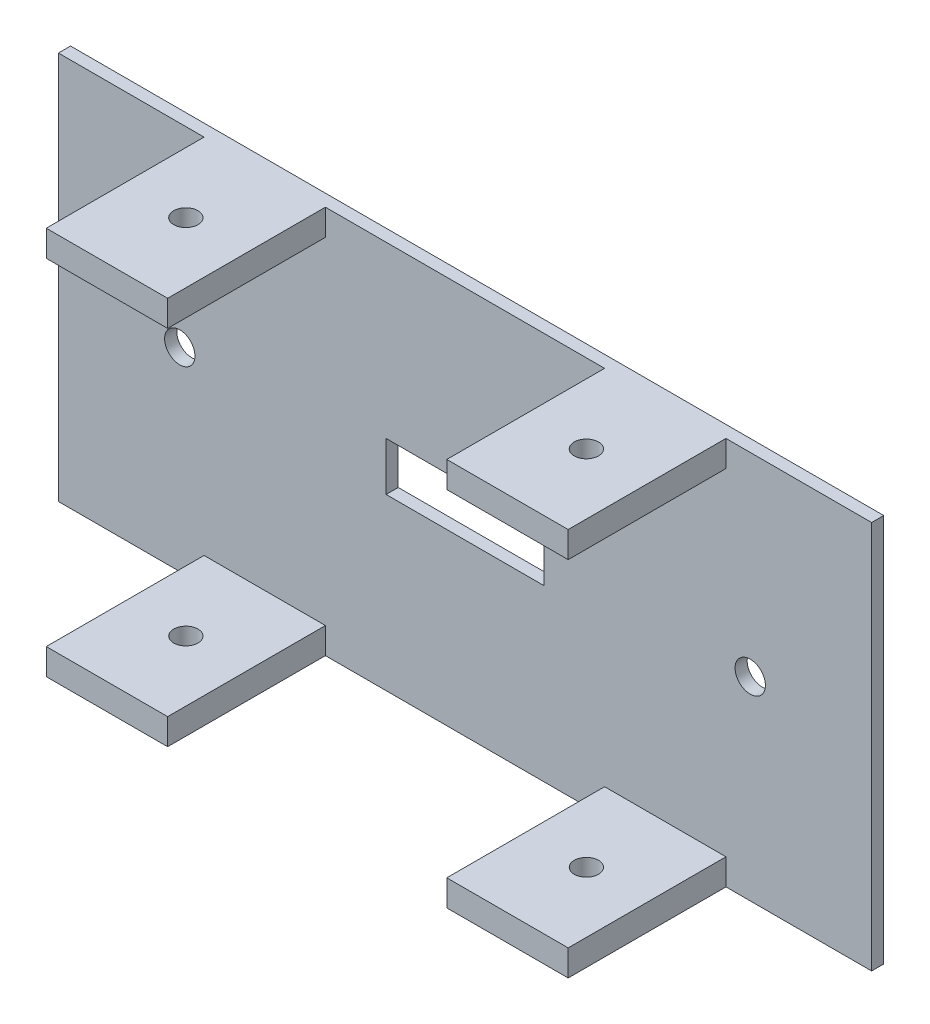
ISO-10303-21;
HEADER;
FILE_DESCRIPTION(('STEP AP214'),'2;1');
FILE_NAME('part.step','',(''),(''),'','','');
FILE_SCHEMA(('AUTOMOTIVE_DESIGN { 1 0 10303 214 1 1 1 1 }'));
ENDSEC;
DATA;
#1=APPLICATION_CONTEXT('core data for automotive mechanical design processes');
#2=APPLICATION_PROTOCOL_DEFINITION('international standard','automotive_design',2000,#1);
#3=PRODUCT_CONTEXT('',#1,'mechanical');
#4=PRODUCT('Part','Part','',(#3));
#5=PRODUCT_RELATED_PRODUCT_CATEGORY('part','',(#4));
#6=PRODUCT_DEFINITION_FORMATION('','',#4);
#7=PRODUCT_DEFINITION_CONTEXT('part definition',#1,'design');
#8=PRODUCT_DEFINITION('design','',#6,#7);
#9=PRODUCT_DEFINITION_SHAPE('','',#8);
#10=(LENGTH_UNIT() NAMED_UNIT(*) SI_UNIT(.MILLI.,.METRE.));
#11=(NAMED_UNIT(*) PLANE_ANGLE_UNIT() SI_UNIT($,.RADIAN.));
#12=(NAMED_UNIT(*) SI_UNIT($,.STERADIAN.) SOLID_ANGLE_UNIT());
#13=UNCERTAINTY_MEASURE_WITH_UNIT(LENGTH_MEASURE(1.E-05),#10,'distance_accuracy_value','');
#14=(GEOMETRIC_REPRESENTATION_CONTEXT(3) GLOBAL_UNCERTAINTY_ASSIGNED_CONTEXT((#13)) GLOBAL_UNIT_ASSIGNED_CONTEXT((#10,
#11,#12)) REPRESENTATION_CONTEXT('',''));
#15=CARTESIAN_POINT('',(0.,0.,0.));
#16=DIRECTION('',(0.,0.,1.));
#17=DIRECTION('',(1.,0.,0.));
#18=AXIS2_PLACEMENT_3D('',#15,#16,#17);
#19=CARTESIAN_POINT('',(0.,0.,2.));
#20=DIRECTION('',(0.,0.,1.));
#21=DIRECTION('',(1.,0.,0.));
#22=AXIS2_PLACEMENT_3D('',#19,#20,#21);
#23=PLANE('',#22);
#24=DIRECTION('',(0.,-1.,0.));
#25=VECTOR('',#24,1.);
#26=CARTESIAN_POINT('',(-13.,0.,2.));
#27=LINE('',#26,#25);
#28=CARTESIAN_POINT('',(-13.,4.,2.));
#29=VERTEX_POINT('',#28);
#30=CARTESIAN_POINT('',(-13.,-4.,2.));
#31=VERTEX_POINT('',#30);
#32=EDGE_CURVE('E268',#29,#31,#27,.T.);
#33=ORIENTED_EDGE('',*,*,#32,.F.);
#34=DIRECTION('',(1.,0.,0.));
#35=VECTOR('',#34,1.);
#36=CARTESIAN_POINT('',(0.,4.,2.));
#37=LINE('',#36,#35);
#38=CARTESIAN_POINT('',(13.,4.,2.));
#39=VERTEX_POINT('',#38);
#40=EDGE_CURVE('E246',#29,#39,#37,.T.);
#41=ORIENTED_EDGE('',*,*,#40,.T.);
#42=DIRECTION('',(0.,-1.,0.));
#43=VECTOR('',#42,1.);
#44=CARTESIAN_POINT('',(13.,0.,2.));
#45=LINE('',#44,#43);
#46=CARTESIAN_POINT('',(13.,-4.,2.));
#47=VERTEX_POINT('',#46);
#48=EDGE_CURVE('E263',#39,#47,#45,.T.);
#49=ORIENTED_EDGE('',*,*,#48,.T.);
#50=DIRECTION('',(1.,0.,0.));
#51=VECTOR('',#50,1.);
#52=CARTESIAN_POINT('',(0.,-4.,2.));
#53=LINE('',#52,#51);
#54=EDGE_CURVE('E37',#31,#47,#53,.T.);
#55=ORIENTED_EDGE('',*,*,#54,.F.);
#56=EDGE_LOOP('',(#33,#41,#49,#55));
#57=FACE_BOUND('',#56,.T.);
#58=DIRECTION('',(1.,0.,0.));
#59=VECTOR('',#58,1.);
#60=CARTESIAN_POINT('',(0.,32.,2.));
#61=LINE('',#60,#59);
#62=CARTESIAN_POINT('',(43.,32.,2.));
#63=VERTEX_POINT('',#62);
#64=CARTESIAN_POINT('',(67.,32.,2.));
#65=VERTEX_POINT('',#64);
#66=EDGE_CURVE('E479',#63,#65,#61,.T.);
#67=ORIENTED_EDGE('',*,*,#66,.F.);
#68=DIRECTION('',(0.,-1.,0.));
#69=VECTOR('',#68,1.);
#70=CARTESIAN_POINT('',(43.,29.85,2.));
#71=LINE('',#70,#69);
#72=CARTESIAN_POINT('',(43.,27.7,2.));
#73=VERTEX_POINT('',#72);
#74=EDGE_CURVE('E301',#63,#73,#71,.T.);
#75=ORIENTED_EDGE('',*,*,#74,.T.);
#76=DIRECTION('',(-1.,0.,0.));
#77=VECTOR('',#76,1.);
#78=CARTESIAN_POINT('',(33.,27.7,2.));
#79=LINE('',#78,#77);
#80=CARTESIAN_POINT('',(23.,27.7,2.));
#81=VERTEX_POINT('',#80);
#82=EDGE_CURVE('E332',#73,#81,#79,.T.);
#83=ORIENTED_EDGE('',*,*,#82,.T.);
#84=DIRECTION('',(0.,-1.,0.));
#85=VECTOR('',#84,1.);
#86=CARTESIAN_POINT('',(23.,29.85,2.));
#87=LINE('',#86,#85);
#88=CARTESIAN_POINT('',(23.,32.,2.));
#89=VERTEX_POINT('',#88);
#90=EDGE_CURVE('E318',#89,#81,#87,.T.);
#91=ORIENTED_EDGE('',*,*,#90,.F.);
#92=CARTESIAN_POINT('',(-23.,32.,2.));
#93=VERTEX_POINT('',#92);
#94=EDGE_CURVE('E478',#93,#89,#61,.T.);
#95=ORIENTED_EDGE('',*,*,#94,.F.);
#96=DIRECTION('',(0.,-1.,0.));
#97=VECTOR('',#96,1.);
#98=CARTESIAN_POINT('',(-23.,29.85,2.));
#99=LINE('',#98,#97);
#100=CARTESIAN_POINT('',(-23.,27.7,2.));
#101=VERTEX_POINT('',#100);
#102=EDGE_CURVE('E431',#93,#101,#99,.T.);
#103=ORIENTED_EDGE('',*,*,#102,.T.);
#104=DIRECTION('',(1.,0.,0.));
#105=VECTOR('',#104,1.);
#106=CARTESIAN_POINT('',(-33.,27.7,2.));
#107=LINE('',#106,#105);
#108=CARTESIAN_POINT('',(-43.,27.7,2.));
#109=VERTEX_POINT('',#108);
#110=EDGE_CURVE('E450',#109,#101,#107,.T.);
#111=ORIENTED_EDGE('',*,*,#110,.F.);
#112=DIRECTION('',(0.,-1.,0.));
#113=VECTOR('',#112,1.);
#114=CARTESIAN_POINT('',(-43.,29.85,2.));
#115=LINE('',#114,#113);
#116=CARTESIAN_POINT('',(-43.,32.,2.));
#117=VERTEX_POINT('',#116);
#118=EDGE_CURVE('E437',#117,#109,#115,.T.);
#119=ORIENTED_EDGE('',*,*,#118,.F.);
#120=CARTESIAN_POINT('',(-67.,32.,2.));
#121=VERTEX_POINT('',#120);
#122=EDGE_CURVE('E473',#121,#117,#61,.T.);
#123=ORIENTED_EDGE('',*,*,#122,.F.);
#124=DIRECTION('',(0.,-1.,0.));
#125=VECTOR('',#124,1.);
#126=CARTESIAN_POINT('',(-67.,0.,2.));
#127=LINE('',#126,#125);
#128=CARTESIAN_POINT('',(-67.,-32.,2.));
#129=VERTEX_POINT('',#128);
#130=EDGE_CURVE('E477',#121,#129,#127,.T.);
#131=ORIENTED_EDGE('',*,*,#130,.T.);
#132=DIRECTION('',(1.,0.,0.));
#133=VECTOR('',#132,1.);
#134=CARTESIAN_POINT('',(0.,-32.,2.));
#135=LINE('',#134,#133);
#136=CARTESIAN_POINT('',(-43.,-32.,2.));
#137=VERTEX_POINT('',#136);
#138=EDGE_CURVE('E483',#129,#137,#135,.T.);
#139=ORIENTED_EDGE('',*,*,#138,.T.);
#140=DIRECTION('',(0.,1.,0.));
#141=VECTOR('',#140,1.);
#142=CARTESIAN_POINT('',(-43.,-29.85,2.));
#143=LINE('',#142,#141);
#144=CARTESIAN_POINT('',(-43.,-27.7,2.));
#145=VERTEX_POINT('',#144);
#146=EDGE_CURVE('E383',#137,#145,#143,.T.);
#147=ORIENTED_EDGE('',*,*,#146,.T.);
#148=DIRECTION('',(1.,0.,0.));
#149=VECTOR('',#148,1.);
#150=CARTESIAN_POINT('',(-33.,-27.7,2.));
#151=LINE('',#150,#149);
#152=CARTESIAN_POINT('',(-23.,-27.7,2.));
#153=VERTEX_POINT('',#152);
#154=EDGE_CURVE('E397',#145,#153,#151,.T.);
#155=ORIENTED_EDGE('',*,*,#154,.T.);
#156=DIRECTION('',(0.,1.,0.));
#157=VECTOR('',#156,1.);
#158=CARTESIAN_POINT('',(-23.,-29.85,2.));
#159=LINE('',#158,#157);
#160=CARTESIAN_POINT('',(-23.,-32.,2.));
#161=VERTEX_POINT('',#160);
#162=EDGE_CURVE('E410',#161,#153,#159,.T.);
#163=ORIENTED_EDGE('',*,*,#162,.F.);
#164=CARTESIAN_POINT('',(23.,-32.,2.));
#165=VERTEX_POINT('',#164);
#166=EDGE_CURVE('E487',#161,#165,#135,.T.);
#167=ORIENTED_EDGE('',*,*,#166,.T.);
#168=DIRECTION('',(0.,1.,0.));
#169=VECTOR('',#168,1.);
#170=CARTESIAN_POINT('',(23.,-29.85,2.));
#171=LINE('',#170,#169);
#172=CARTESIAN_POINT('',(23.,-27.7,2.));
#173=VERTEX_POINT('',#172);
#174=EDGE_CURVE('E342',#165,#173,#171,.T.);
#175=ORIENTED_EDGE('',*,*,#174,.T.);
#176=DIRECTION('',(-1.,0.,0.));
#177=VECTOR('',#176,1.);
#178=CARTESIAN_POINT('',(33.,-27.7,2.));
#179=LINE('',#178,#177);
#180=CARTESIAN_POINT('',(43.,-27.7,2.));
#181=VERTEX_POINT('',#180);
#182=EDGE_CURVE('E373',#181,#173,#179,.T.);
#183=ORIENTED_EDGE('',*,*,#182,.F.);
#184=DIRECTION('',(0.,1.,0.));
#185=VECTOR('',#184,1.);
#186=CARTESIAN_POINT('',(43.,-29.85,2.));
#187=LINE('',#186,#185);
#188=CARTESIAN_POINT('',(43.,-32.,2.));
#189=VERTEX_POINT('',#188);
#190=EDGE_CURVE('E359',#189,#181,#187,.T.);
#191=ORIENTED_EDGE('',*,*,#190,.F.);
#192=CARTESIAN_POINT('',(67.,-32.,2.));
#193=VERTEX_POINT('',#192);
#194=EDGE_CURVE('E482',#189,#193,#135,.T.);
#195=ORIENTED_EDGE('',*,*,#194,.T.);
#196=DIRECTION('',(0.,-1.,0.));
#197=VECTOR('',#196,1.);
#198=CARTESIAN_POINT('',(67.,0.,2.));
#199=LINE('',#198,#197);
#200=EDGE_CURVE('E486',#65,#193,#199,.T.);
#201=ORIENTED_EDGE('',*,*,#200,.F.);
#202=EDGE_LOOP('',(#67,#75,#83,#91,#95,#103,#111,#119,#123,#131,#139,#147,#155,#163,#167,#175,
#183,#191,#195,#201));
#203=FACE_BOUND('',#202,.T.);
#204=CARTESIAN_POINT('',(-47.,0.,2.));
#205=DIRECTION('',(0.,0.,1.));
#206=DIRECTION('',(1.,0.,0.));
#207=AXIS2_PLACEMENT_3D('',#204,#205,#206);
#208=CIRCLE('',#207,2.5);
#209=CARTESIAN_POINT('',(-44.5,0.,2.));
#210=VERTEX_POINT('',#209);
#211=EDGE_CURVE('E839',#210,#210,#208,.T.);
#212=ORIENTED_EDGE('',*,*,#211,.F.);
#213=EDGE_LOOP('',(#212));
#214=FACE_BOUND('',#213,.T.);
#215=CARTESIAN_POINT('',(47.,0.,2.));
#216=DIRECTION('',(0.,0.,-1.));
#217=DIRECTION('',(1.,0.,0.));
#218=AXIS2_PLACEMENT_3D('',#215,#216,#217);
#219=CIRCLE('',#218,2.5);
#220=CARTESIAN_POINT('',(49.5,0.,2.));
#221=VERTEX_POINT('',#220);
#222=EDGE_CURVE('E834',#221,#221,#219,.T.);
#223=ORIENTED_EDGE('',*,*,#222,.T.);
#224=EDGE_LOOP('',(#223));
#225=FACE_BOUND('',#224,.T.);
#226=ADVANCED_FACE('F16',(#57,#203,#214,#225),#23,.T.);
#227=CARTESIAN_POINT('',(0.,0.,0.));
#228=DIRECTION('',(0.,0.,1.));
#229=DIRECTION('',(1.,0.,0.));
#230=AXIS2_PLACEMENT_3D('',#227,#228,#229);
#231=PLANE('',#230);
#232=CARTESIAN_POINT('',(-47.,0.,0.));
#233=DIRECTION('',(0.,0.,1.));
#234=DIRECTION('',(1.,0.,0.));
#235=AXIS2_PLACEMENT_3D('',#232,#233,#234);
#236=CIRCLE('',#235,2.5);
#237=CARTESIAN_POINT('',(-44.5,0.,0.));
#238=VERTEX_POINT('',#237);
#239=EDGE_CURVE('E266',#238,#238,#236,.T.);
#240=ORIENTED_EDGE('',*,*,#239,.T.);
#241=EDGE_LOOP('',(#240));
#242=FACE_BOUND('',#241,.T.);
#243=DIRECTION('',(1.,0.,0.));
#244=VECTOR('',#243,1.);
#245=CARTESIAN_POINT('',(0.,32.,0.));
#246=LINE('',#245,#244);
#247=CARTESIAN_POINT('',(-67.,32.,0.));
#248=VERTEX_POINT('',#247);
#249=CARTESIAN_POINT('',(67.,32.,0.));
#250=VERTEX_POINT('',#249);
#251=EDGE_CURVE('E461',#248,#250,#246,.T.);
#252=ORIENTED_EDGE('',*,*,#251,.T.);
#253=DIRECTION('',(0.,-1.,0.));
#254=VECTOR('',#253,1.);
#255=CARTESIAN_POINT('',(67.,0.,0.));
#256=LINE('',#255,#254);
#257=CARTESIAN_POINT('',(67.,-32.,0.));
#258=VERTEX_POINT('',#257);
#259=EDGE_CURVE('E502',#250,#258,#256,.T.);
#260=ORIENTED_EDGE('',*,*,#259,.T.);
#261=DIRECTION('',(1.,0.,0.));
#262=VECTOR('',#261,1.);
#263=CARTESIAN_POINT('',(0.,-32.,0.));
#264=LINE('',#263,#262);
#265=CARTESIAN_POINT('',(-67.,-32.,0.));
#266=VERTEX_POINT('',#265);
#267=EDGE_CURVE('E498',#266,#258,#264,.T.);
#268=ORIENTED_EDGE('',*,*,#267,.F.);
#269=DIRECTION('',(0.,-1.,0.));
#270=VECTOR('',#269,1.);
#271=CARTESIAN_POINT('',(-67.,0.,0.));
#272=LINE('',#271,#270);
#273=EDGE_CURVE('E495',#248,#266,#272,.T.);
#274=ORIENTED_EDGE('',*,*,#273,.F.);
#275=EDGE_LOOP('',(#252,#260,#268,#274));
#276=FACE_BOUND('',#275,.T.);
#277=DIRECTION('',(1.,0.,0.));
#278=VECTOR('',#277,1.);
#279=CARTESIAN_POINT('',(0.,4.,0.));
#280=LINE('',#279,#278);
#281=CARTESIAN_POINT('',(-13.,4.,0.));
#282=VERTEX_POINT('',#281);
#283=CARTESIAN_POINT('',(13.,4.,0.));
#284=VERTEX_POINT('',#283);
#285=EDGE_CURVE('E49',#282,#284,#280,.T.);
#286=ORIENTED_EDGE('',*,*,#285,.F.);
#287=DIRECTION('',(0.,-1.,0.));
#288=VECTOR('',#287,1.);
#289=CARTESIAN_POINT('',(-13.,0.,0.));
#290=LINE('',#289,#288);
#291=CARTESIAN_POINT('',(-13.,-4.,0.));
#292=VERTEX_POINT('',#291);
#293=EDGE_CURVE('E251',#282,#292,#290,.T.);
#294=ORIENTED_EDGE('',*,*,#293,.T.);
#295=DIRECTION('',(1.,0.,0.));
#296=VECTOR('',#295,1.);
#297=CARTESIAN_POINT('',(0.,-4.,0.));
#298=LINE('',#297,#296);
#299=CARTESIAN_POINT('',(13.,-4.,0.));
#300=VERTEX_POINT('',#299);
#301=EDGE_CURVE('E232',#292,#300,#298,.T.);
#302=ORIENTED_EDGE('',*,*,#301,.T.);
#303=DIRECTION('',(0.,-1.,0.));
#304=VECTOR('',#303,1.);
#305=CARTESIAN_POINT('',(13.,0.,0.));
#306=LINE('',#305,#304);
#307=EDGE_CURVE('E242',#284,#300,#306,.T.);
#308=ORIENTED_EDGE('',*,*,#307,.F.);
#309=EDGE_LOOP('',(#286,#294,#302,#308));
#310=FACE_BOUND('',#309,.T.);
#311=CARTESIAN_POINT('',(47.,0.,0.));
#312=DIRECTION('',(0.,0.,-1.));
#313=DIRECTION('',(1.,0.,0.));
#314=AXIS2_PLACEMENT_3D('',#311,#312,#313);
#315=CIRCLE('',#314,2.5);
#316=CARTESIAN_POINT('',(49.5,0.,0.));
#317=VERTEX_POINT('',#316);
#318=EDGE_CURVE('E831',#317,#317,#315,.T.);
#319=ORIENTED_EDGE('',*,*,#318,.F.);
#320=EDGE_LOOP('',(#319));
#321=FACE_BOUND('',#320,.T.);
#322=ADVANCED_FACE('F248',(#242,#276,#310,#321),#231,.F.);
#323=CARTESIAN_POINT('',(0.,32.,2.));
#324=DIRECTION('',(0.,1.,0.));
#325=DIRECTION('',(-1.,0.,0.));
#326=AXIS2_PLACEMENT_3D('',#323,#324,#325);
#327=PLANE('',#326);
#328=CARTESIAN_POINT('',(-33.,32.,15.));
#329=DIRECTION('',(0.,-1.,0.));
#330=DIRECTION('',(-1.,0.,0.));
#331=AXIS2_PLACEMENT_3D('',#328,#329,#330);
#332=CIRCLE('',#331,2.);
#333=CARTESIAN_POINT('',(-35.,32.,15.));
#334=VERTEX_POINT('',#333);
#335=EDGE_CURVE('E276',#334,#334,#332,.T.);
#336=ORIENTED_EDGE('',*,*,#335,.T.);
#337=EDGE_LOOP('',(#336));
#338=FACE_BOUND('',#337,.T.);
#339=ORIENTED_EDGE('',*,*,#251,.F.);
#340=DIRECTION('',(0.,0.,-1.));
#341=VECTOR('',#340,1.);
#342=CARTESIAN_POINT('',(-67.,32.,2.));
#343=LINE('',#342,#341);
#344=EDGE_CURVE('E10',#121,#248,#343,.T.);
#345=ORIENTED_EDGE('',*,*,#344,.F.);
#346=ORIENTED_EDGE('',*,*,#122,.T.);
#347=DIRECTION('',(0.,0.,-1.));
#348=VECTOR('',#347,1.);
#349=CARTESIAN_POINT('',(-43.,32.,28.));
#350=LINE('',#349,#348);
#351=CARTESIAN_POINT('',(-43.,32.,28.));
#352=VERTEX_POINT('',#351);
#353=EDGE_CURVE('E457',#352,#117,#350,.T.);
#354=ORIENTED_EDGE('',*,*,#353,.F.);
#355=DIRECTION('',(1.,0.,0.));
#356=VECTOR('',#355,1.);
#357=CARTESIAN_POINT('',(0.,32.,28.));
#358=LINE('',#357,#356);
#359=CARTESIAN_POINT('',(-23.,32.,28.));
#360=VERTEX_POINT('',#359);
#361=EDGE_CURVE('E443',#352,#360,#358,.T.);
#362=ORIENTED_EDGE('',*,*,#361,.T.);
#363=DIRECTION('',(0.,0.,-1.));
#364=VECTOR('',#363,1.);
#365=CARTESIAN_POINT('',(-23.,32.,28.));
#366=LINE('',#365,#364);
#367=EDGE_CURVE('E447',#360,#93,#366,.T.);
#368=ORIENTED_EDGE('',*,*,#367,.T.);
#369=ORIENTED_EDGE('',*,*,#94,.T.);
#370=DIRECTION('',(0.,0.,-1.));
#371=VECTOR('',#370,1.);
#372=CARTESIAN_POINT('',(23.,32.,28.));
#373=LINE('',#372,#371);
#374=CARTESIAN_POINT('',(23.,32.,28.));
#375=VERTEX_POINT('',#374);
#376=EDGE_CURVE('E338',#375,#89,#373,.T.);
#377=ORIENTED_EDGE('',*,*,#376,.F.);
#378=DIRECTION('',(1.,0.,0.));
#379=VECTOR('',#378,1.);
#380=CARTESIAN_POINT('',(0.,32.,28.));
#381=LINE('',#380,#379);
#382=CARTESIAN_POINT('',(43.,32.,28.));
#383=VERTEX_POINT('',#382);
#384=EDGE_CURVE('E325',#375,#383,#381,.T.);
#385=ORIENTED_EDGE('',*,*,#384,.T.);
#386=DIRECTION('',(0.,0.,-1.));
#387=VECTOR('',#386,1.);
#388=CARTESIAN_POINT('',(43.,32.,28.));
#389=LINE('',#388,#387);
#390=EDGE_CURVE('E329',#383,#63,#389,.T.);
#391=ORIENTED_EDGE('',*,*,#390,.T.);
#392=ORIENTED_EDGE('',*,*,#66,.T.);
#393=DIRECTION('',(0.,0.,-1.));
#394=VECTOR('',#393,1.);
#395=CARTESIAN_POINT('',(67.,32.,2.));
#396=LINE('',#395,#394);
#397=EDGE_CURVE('E491',#65,#250,#396,.T.);
#398=ORIENTED_EDGE('',*,*,#397,.T.);
#399=EDGE_LOOP('',(#339,#345,#346,#354,#362,#368,#369,#377,#385,#391,#392,#398));
#400=FACE_BOUND('',#399,.T.);
#401=CARTESIAN_POINT('',(33.,32.,15.));
#402=DIRECTION('',(0.,1.,0.));
#403=DIRECTION('',(-1.,0.,0.));
#404=AXIS2_PLACEMENT_3D('',#401,#402,#403);
#405=CIRCLE('',#404,2.);
#406=CARTESIAN_POINT('',(31.,32.,15.));
#407=VERTEX_POINT('',#406);
#408=EDGE_CURVE('E286',#407,#407,#405,.T.);
#409=ORIENTED_EDGE('',*,*,#408,.F.);
#410=EDGE_LOOP('',(#409));
#411=FACE_BOUND('',#410,.T.);
#412=ADVANCED_FACE('F18',(#338,#400,#411),#327,.T.);
#413=CARTESIAN_POINT('',(0.,-32.,2.));
#414=DIRECTION('',(0.,1.,0.));
#415=DIRECTION('',(-1.,0.,0.));
#416=AXIS2_PLACEMENT_3D('',#413,#414,#415);
#417=PLANE('',#416);
#418=ORIENTED_EDGE('',*,*,#267,.T.);
#419=DIRECTION('',(0.,0.,-1.));
#420=VECTOR('',#419,1.);
#421=CARTESIAN_POINT('',(67.,-32.,2.));
#422=LINE('',#421,#420);
#423=EDGE_CURVE('E508',#193,#258,#422,.T.);
#424=ORIENTED_EDGE('',*,*,#423,.F.);
#425=ORIENTED_EDGE('',*,*,#194,.F.);
#426=DIRECTION('',(0.,0.,-1.));
#427=VECTOR('',#426,1.);
#428=CARTESIAN_POINT('',(43.,-32.,28.));
#429=LINE('',#428,#427);
#430=CARTESIAN_POINT('',(43.,-32.,28.));
#431=VERTEX_POINT('',#430);
#432=EDGE_CURVE('E380',#431,#189,#429,.T.);
#433=ORIENTED_EDGE('',*,*,#432,.F.);
#434=DIRECTION('',(1.,0.,0.));
#435=VECTOR('',#434,1.);
#436=CARTESIAN_POINT('',(0.,-32.,28.));
#437=LINE('',#436,#435);
#438=CARTESIAN_POINT('',(23.,-32.,28.));
#439=VERTEX_POINT('',#438);
#440=EDGE_CURVE('E365',#439,#431,#437,.T.);
#441=ORIENTED_EDGE('',*,*,#440,.F.);
#442=DIRECTION('',(0.,0.,-1.));
#443=VECTOR('',#442,1.);
#444=CARTESIAN_POINT('',(23.,-32.,28.));
#445=LINE('',#444,#443);
#446=EDGE_CURVE('E369',#439,#165,#445,.T.);
#447=ORIENTED_EDGE('',*,*,#446,.T.);
#448=ORIENTED_EDGE('',*,*,#166,.F.);
#449=DIRECTION('',(0.,0.,-1.));
#450=VECTOR('',#449,1.);
#451=CARTESIAN_POINT('',(-23.,-32.,28.));
#452=LINE('',#451,#450);
#453=CARTESIAN_POINT('',(-23.,-32.,28.));
#454=VERTEX_POINT('',#453);
#455=EDGE_CURVE('E423',#454,#161,#452,.T.);
#456=ORIENTED_EDGE('',*,*,#455,.F.);
#457=DIRECTION('',(1.,0.,0.));
#458=VECTOR('',#457,1.);
#459=CARTESIAN_POINT('',(0.,-32.,28.));
#460=LINE('',#459,#458);
#461=CARTESIAN_POINT('',(-43.,-32.,28.));
#462=VERTEX_POINT('',#461);
#463=EDGE_CURVE('E396',#462,#454,#460,.T.);
#464=ORIENTED_EDGE('',*,*,#463,.F.);
#465=DIRECTION('',(0.,0.,-1.));
#466=VECTOR('',#465,1.);
#467=CARTESIAN_POINT('',(-43.,-32.,28.));
#468=LINE('',#467,#466);
#469=EDGE_CURVE('E427',#462,#137,#468,.T.);
#470=ORIENTED_EDGE('',*,*,#469,.T.);
#471=ORIENTED_EDGE('',*,*,#138,.F.);
#472=DIRECTION('',(0.,0.,-1.));
#473=VECTOR('',#472,1.);
#474=CARTESIAN_POINT('',(-67.,-32.,2.));
#475=LINE('',#474,#473);
#476=EDGE_CURVE('E25',#129,#266,#475,.T.);
#477=ORIENTED_EDGE('',*,*,#476,.T.);
#478=EDGE_LOOP('',(#418,#424,#425,#433,#441,#447,#448,#456,#464,#470,#471,#477));
#479=FACE_BOUND('',#478,.T.);
#480=CARTESIAN_POINT('',(33.,-32.,15.));
#481=DIRECTION('',(0.,1.,0.));
#482=DIRECTION('',(1.,0.,0.));
#483=AXIS2_PLACEMENT_3D('',#480,#481,#482);
#484=CIRCLE('',#483,2.);
#485=CARTESIAN_POINT('',(35.,-32.,15.));
#486=VERTEX_POINT('',#485);
#487=EDGE_CURVE('E285',#486,#486,#484,.T.);
#488=ORIENTED_EDGE('',*,*,#487,.T.);
#489=EDGE_LOOP('',(#488));
#490=FACE_BOUND('',#489,.T.);
#491=CARTESIAN_POINT('',(-33.,-32.,15.));
#492=DIRECTION('',(0.,-1.,0.));
#493=DIRECTION('',(1.,0.,0.));
#494=AXIS2_PLACEMENT_3D('',#491,#492,#493);
#495=CIRCLE('',#494,2.);
#496=CARTESIAN_POINT('',(-31.,-32.,15.));
#497=VERTEX_POINT('',#496);
#498=EDGE_CURVE('E302',#497,#497,#495,.T.);
#499=ORIENTED_EDGE('',*,*,#498,.F.);
#500=EDGE_LOOP('',(#499));
#501=FACE_BOUND('',#500,.T.);
#502=ADVANCED_FACE('F517',(#479,#490,#501),#417,.F.);
#503=CARTESIAN_POINT('',(-67.,0.,2.));
#504=DIRECTION('',(1.,0.,0.));
#505=DIRECTION('',(0.,0.,-1.));
#506=AXIS2_PLACEMENT_3D('',#503,#504,#505);
#507=PLANE('',#506);
#508=ORIENTED_EDGE('',*,*,#273,.T.);
#509=ORIENTED_EDGE('',*,*,#476,.F.);
#510=ORIENTED_EDGE('',*,*,#130,.F.);
#511=ORIENTED_EDGE('',*,*,#344,.T.);
#512=EDGE_LOOP('',(#508,#509,#510,#511));
#513=FACE_BOUND('',#512,.T.);
#514=ADVANCED_FACE('F559',(#513),#507,.F.);
#515=CARTESIAN_POINT('',(67.,0.,2.));
#516=DIRECTION('',(1.,0.,0.));
#517=DIRECTION('',(0.,0.,-1.));
#518=AXIS2_PLACEMENT_3D('',#515,#516,#517);
#519=PLANE('',#518);
#520=ORIENTED_EDGE('',*,*,#259,.F.);
#521=ORIENTED_EDGE('',*,*,#397,.F.);
#522=ORIENTED_EDGE('',*,*,#200,.T.);
#523=ORIENTED_EDGE('',*,*,#423,.T.);
#524=EDGE_LOOP('',(#520,#521,#522,#523));
#525=FACE_BOUND('',#524,.T.);
#526=ADVANCED_FACE('F528',(#525),#519,.T.);
#527=CARTESIAN_POINT('',(-43.,29.85,28.));
#528=DIRECTION('',(1.,0.,0.));
#529=DIRECTION('',(0.,0.,-1.));
#530=AXIS2_PLACEMENT_3D('',#527,#528,#529);
#531=PLANE('',#530);
#532=ORIENTED_EDGE('',*,*,#118,.T.);
#533=DIRECTION('',(0.,0.,-1.));
#534=VECTOR('',#533,1.);
#535=CARTESIAN_POINT('',(-43.,27.7,28.));
#536=LINE('',#535,#534);
#537=CARTESIAN_POINT('',(-43.,27.7,28.));
#538=VERTEX_POINT('',#537);
#539=EDGE_CURVE('E462',#538,#109,#536,.T.);
#540=ORIENTED_EDGE('',*,*,#539,.F.);
#541=DIRECTION('',(0.,-1.,0.));
#542=VECTOR('',#541,1.);
#543=CARTESIAN_POINT('',(-43.,29.85,28.));
#544=LINE('',#543,#542);
#545=EDGE_CURVE('E440',#352,#538,#544,.T.);
#546=ORIENTED_EDGE('',*,*,#545,.F.);
#547=ORIENTED_EDGE('',*,*,#353,.T.);
#548=EDGE_LOOP('',(#532,#540,#546,#547));
#549=FACE_BOUND('',#548,.T.);
#550=ADVANCED_FACE('F609',(#549),#531,.F.);
#551=CARTESIAN_POINT('',(-33.,27.7,28.));
#552=DIRECTION('',(0.,1.,0.));
#553=DIRECTION('',(0.,0.,1.));
#554=AXIS2_PLACEMENT_3D('',#551,#552,#553);
#555=PLANE('',#554);
#556=CARTESIAN_POINT('',(-33.,27.7,15.));
#557=DIRECTION('',(0.,-1.,0.));
#558=DIRECTION('',(-1.,0.,0.));
#559=AXIS2_PLACEMENT_3D('',#556,#557,#558);
#560=CIRCLE('',#559,2.);
#561=CARTESIAN_POINT('',(-35.,27.7,15.));
#562=VERTEX_POINT('',#561);
#563=EDGE_CURVE('E290',#562,#562,#560,.T.);
#564=ORIENTED_EDGE('',*,*,#563,.F.);
#565=EDGE_LOOP('',(#564));
#566=FACE_BOUND('',#565,.T.);
#567=ORIENTED_EDGE('',*,*,#110,.T.);
#568=DIRECTION('',(0.,0.,-1.));
#569=VECTOR('',#568,1.);
#570=CARTESIAN_POINT('',(-23.,27.7,28.));
#571=LINE('',#570,#569);
#572=CARTESIAN_POINT('',(-23.,27.7,28.));
#573=VERTEX_POINT('',#572);
#574=EDGE_CURVE('E466',#573,#101,#571,.T.);
#575=ORIENTED_EDGE('',*,*,#574,.F.);
#576=DIRECTION('',(1.,0.,0.));
#577=VECTOR('',#576,1.);
#578=CARTESIAN_POINT('',(-33.,27.7,28.));
#579=LINE('',#578,#577);
#580=EDGE_CURVE('E436',#538,#573,#579,.T.);
#581=ORIENTED_EDGE('',*,*,#580,.F.);
#582=ORIENTED_EDGE('',*,*,#539,.T.);
#583=EDGE_LOOP('',(#567,#575,#581,#582));
#584=FACE_BOUND('',#583,.T.);
#585=ADVANCED_FACE('F626',(#566,#584),#555,.F.);
#586=CARTESIAN_POINT('',(-23.,29.85,28.));
#587=DIRECTION('',(1.,0.,0.));
#588=DIRECTION('',(0.,0.,-1.));
#589=AXIS2_PLACEMENT_3D('',#586,#587,#588);
#590=PLANE('',#589);
#591=ORIENTED_EDGE('',*,*,#102,.F.);
#592=ORIENTED_EDGE('',*,*,#367,.F.);
#593=DIRECTION('',(0.,-1.,0.));
#594=VECTOR('',#593,1.);
#595=CARTESIAN_POINT('',(-23.,29.85,28.));
#596=LINE('',#595,#594);
#597=EDGE_CURVE('E432',#360,#573,#596,.T.);
#598=ORIENTED_EDGE('',*,*,#597,.T.);
#599=ORIENTED_EDGE('',*,*,#574,.T.);
#600=EDGE_LOOP('',(#591,#592,#598,#599));
#601=FACE_BOUND('',#600,.T.);
#602=ADVANCED_FACE('F604',(#601),#590,.T.);
#603=CARTESIAN_POINT('',(0.,0.,28.));
#604=DIRECTION('',(0.,0.,1.));
#605=DIRECTION('',(1.,0.,0.));
#606=AXIS2_PLACEMENT_3D('',#603,#604,#605);
#607=PLANE('',#606);
#608=ORIENTED_EDGE('',*,*,#361,.F.);
#609=ORIENTED_EDGE('',*,*,#545,.T.);
#610=ORIENTED_EDGE('',*,*,#580,.T.);
#611=ORIENTED_EDGE('',*,*,#597,.F.);
#612=EDGE_LOOP('',(#608,#609,#610,#611));
#613=FACE_BOUND('',#612,.T.);
#614=ADVANCED_FACE('F639',(#613),#607,.T.);
#615=CARTESIAN_POINT('',(-43.,-29.85,28.));
#616=DIRECTION('',(-1.,0.,0.));
#617=DIRECTION('',(0.,0.,1.));
#618=AXIS2_PLACEMENT_3D('',#615,#616,#617);
#619=PLANE('',#618);
#620=ORIENTED_EDGE('',*,*,#146,.F.);
#621=ORIENTED_EDGE('',*,*,#469,.F.);
#622=DIRECTION('',(0.,1.,0.));
#623=VECTOR('',#622,1.);
#624=CARTESIAN_POINT('',(-43.,-29.85,28.));
#625=LINE('',#624,#623);
#626=CARTESIAN_POINT('',(-43.,-27.7,28.));
#627=VERTEX_POINT('',#626);
#628=EDGE_CURVE('E392',#462,#627,#625,.T.);
#629=ORIENTED_EDGE('',*,*,#628,.T.);
#630=DIRECTION('',(0.,0.,-1.));
#631=VECTOR('',#630,1.);
#632=CARTESIAN_POINT('',(-43.,-27.7,28.));
#633=LINE('',#632,#631);
#634=EDGE_CURVE('E407',#627,#145,#633,.T.);
#635=ORIENTED_EDGE('',*,*,#634,.T.);
#636=EDGE_LOOP('',(#620,#621,#629,#635));
#637=FACE_BOUND('',#636,.T.);
#638=ADVANCED_FACE('F556',(#637),#619,.T.);
#639=CARTESIAN_POINT('',(-23.,-29.85,28.));
#640=DIRECTION('',(-1.,0.,0.));
#641=DIRECTION('',(0.,0.,1.));
#642=AXIS2_PLACEMENT_3D('',#639,#640,#641);
#643=PLANE('',#642);
#644=ORIENTED_EDGE('',*,*,#162,.T.);
#645=DIRECTION('',(0.,0.,-1.));
#646=VECTOR('',#645,1.);
#647=CARTESIAN_POINT('',(-23.,-27.7,28.));
#648=LINE('',#647,#646);
#649=CARTESIAN_POINT('',(-23.,-27.7,28.));
#650=VERTEX_POINT('',#649);
#651=EDGE_CURVE('E419',#650,#153,#648,.T.);
#652=ORIENTED_EDGE('',*,*,#651,.F.);
#653=DIRECTION('',(0.,1.,0.));
#654=VECTOR('',#653,1.);
#655=CARTESIAN_POINT('',(-23.,-29.85,28.));
#656=LINE('',#655,#654);
#657=EDGE_CURVE('E400',#454,#650,#656,.T.);
#658=ORIENTED_EDGE('',*,*,#657,.F.);
#659=ORIENTED_EDGE('',*,*,#455,.T.);
#660=EDGE_LOOP('',(#644,#652,#658,#659));
#661=FACE_BOUND('',#660,.T.);
#662=ADVANCED_FACE('F548',(#661),#643,.F.);
#663=CARTESIAN_POINT('',(-33.,-27.7,28.));
#664=DIRECTION('',(0.,1.,0.));
#665=DIRECTION('',(0.,0.,1.));
#666=AXIS2_PLACEMENT_3D('',#663,#664,#665);
#667=PLANE('',#666);
#668=CARTESIAN_POINT('',(-33.,-27.7,15.));
#669=DIRECTION('',(0.,-1.,0.));
#670=DIRECTION('',(1.,0.,0.));
#671=AXIS2_PLACEMENT_3D('',#668,#669,#670);
#672=CIRCLE('',#671,2.);
#673=CARTESIAN_POINT('',(-31.,-27.7,15.));
#674=VERTEX_POINT('',#673);
#675=EDGE_CURVE('E297',#674,#674,#672,.T.);
#676=ORIENTED_EDGE('',*,*,#675,.T.);
#677=EDGE_LOOP('',(#676));
#678=FACE_BOUND('',#677,.T.);
#679=ORIENTED_EDGE('',*,*,#154,.F.);
#680=ORIENTED_EDGE('',*,*,#634,.F.);
#681=DIRECTION('',(1.,0.,0.));
#682=VECTOR('',#681,1.);
#683=CARTESIAN_POINT('',(-33.,-27.7,28.));
#684=LINE('',#683,#682);
#685=EDGE_CURVE('E403',#627,#650,#684,.T.);
#686=ORIENTED_EDGE('',*,*,#685,.T.);
#687=ORIENTED_EDGE('',*,*,#651,.T.);
#688=EDGE_LOOP('',(#679,#680,#686,#687));
#689=FACE_BOUND('',#688,.T.);
#690=ADVANCED_FACE('F656',(#678,#689),#667,.T.);
#691=CARTESIAN_POINT('',(0.,0.,28.));
#692=DIRECTION('',(0.,0.,1.));
#693=DIRECTION('',(1.,0.,0.));
#694=AXIS2_PLACEMENT_3D('',#691,#692,#693);
#695=PLANE('',#694);
#696=ORIENTED_EDGE('',*,*,#628,.F.);
#697=ORIENTED_EDGE('',*,*,#463,.T.);
#698=ORIENTED_EDGE('',*,*,#657,.T.);
#699=ORIENTED_EDGE('',*,*,#685,.F.);
#700=EDGE_LOOP('',(#696,#697,#698,#699));
#701=FACE_BOUND('',#700,.T.);
#702=ADVANCED_FACE('F553',(#701),#695,.T.);
#703=CARTESIAN_POINT('',(43.,-29.85,28.));
#704=DIRECTION('',(-1.,0.,0.));
#705=DIRECTION('',(0.,0.,1.));
#706=AXIS2_PLACEMENT_3D('',#703,#704,#705);
#707=PLANE('',#706);
#708=ORIENTED_EDGE('',*,*,#190,.T.);
#709=DIRECTION('',(0.,0.,-1.));
#710=VECTOR('',#709,1.);
#711=CARTESIAN_POINT('',(43.,-27.7,28.));
#712=LINE('',#711,#710);
#713=CARTESIAN_POINT('',(43.,-27.7,28.));
#714=VERTEX_POINT('',#713);
#715=EDGE_CURVE('E384',#714,#181,#712,.T.);
#716=ORIENTED_EDGE('',*,*,#715,.F.);
#717=DIRECTION('',(0.,1.,0.));
#718=VECTOR('',#717,1.);
#719=CARTESIAN_POINT('',(43.,-29.85,28.));
#720=LINE('',#719,#718);
#721=EDGE_CURVE('E362',#431,#714,#720,.T.);
#722=ORIENTED_EDGE('',*,*,#721,.F.);
#723=ORIENTED_EDGE('',*,*,#432,.T.);
#724=EDGE_LOOP('',(#708,#716,#722,#723));
#725=FACE_BOUND('',#724,.T.);
#726=ADVANCED_FACE('F670',(#725),#707,.F.);
#727=CARTESIAN_POINT('',(33.,-27.7,28.));
#728=DIRECTION('',(0.,-1.,0.));
#729=DIRECTION('',(0.,0.,-1.));
#730=AXIS2_PLACEMENT_3D('',#727,#728,#729);
#731=PLANE('',#730);
#732=CARTESIAN_POINT('',(33.,-27.7,15.));
#733=DIRECTION('',(0.,1.,0.));
#734=DIRECTION('',(1.,0.,0.));
#735=AXIS2_PLACEMENT_3D('',#732,#733,#734);
#736=CIRCLE('',#735,2.);
#737=CARTESIAN_POINT('',(35.,-27.7,15.));
#738=VERTEX_POINT('',#737);
#739=EDGE_CURVE('E306',#738,#738,#736,.T.);
#740=ORIENTED_EDGE('',*,*,#739,.F.);
#741=EDGE_LOOP('',(#740));
#742=FACE_BOUND('',#741,.T.);
#743=ORIENTED_EDGE('',*,*,#182,.T.);
#744=DIRECTION('',(0.,0.,-1.));
#745=VECTOR('',#744,1.);
#746=CARTESIAN_POINT('',(23.,-27.7,28.));
#747=LINE('',#746,#745);
#748=CARTESIAN_POINT('',(23.,-27.7,28.));
#749=VERTEX_POINT('',#748);
#750=EDGE_CURVE('E387',#749,#173,#747,.T.);
#751=ORIENTED_EDGE('',*,*,#750,.F.);
#752=DIRECTION('',(-1.,0.,0.));
#753=VECTOR('',#752,1.);
#754=CARTESIAN_POINT('',(33.,-27.7,28.));
#755=LINE('',#754,#753);
#756=EDGE_CURVE('E358',#714,#749,#755,.T.);
#757=ORIENTED_EDGE('',*,*,#756,.F.);
#758=ORIENTED_EDGE('',*,*,#715,.T.);
#759=EDGE_LOOP('',(#743,#751,#757,#758));
#760=FACE_BOUND('',#759,.T.);
#761=ADVANCED_FACE('F676',(#742,#760),#731,.F.);
#762=CARTESIAN_POINT('',(23.,-29.85,28.));
#763=DIRECTION('',(-1.,0.,0.));
#764=DIRECTION('',(0.,0.,1.));
#765=AXIS2_PLACEMENT_3D('',#762,#763,#764);
#766=PLANE('',#765);
#767=ORIENTED_EDGE('',*,*,#174,.F.);
#768=ORIENTED_EDGE('',*,*,#446,.F.);
#769=DIRECTION('',(0.,1.,0.));
#770=VECTOR('',#769,1.);
#771=CARTESIAN_POINT('',(23.,-29.85,28.));
#772=LINE('',#771,#770);
#773=EDGE_CURVE('E354',#439,#749,#772,.T.);
#774=ORIENTED_EDGE('',*,*,#773,.T.);
#775=ORIENTED_EDGE('',*,*,#750,.T.);
#776=EDGE_LOOP('',(#767,#768,#774,#775));
#777=FACE_BOUND('',#776,.T.);
#778=ADVANCED_FACE('F683',(#777),#766,.T.);
#779=CARTESIAN_POINT('',(0.,0.,28.));
#780=DIRECTION('',(0.,0.,1.));
#781=DIRECTION('',(1.,0.,0.));
#782=AXIS2_PLACEMENT_3D('',#779,#780,#781);
#783=PLANE('',#782);
#784=ORIENTED_EDGE('',*,*,#440,.T.);
#785=ORIENTED_EDGE('',*,*,#721,.T.);
#786=ORIENTED_EDGE('',*,*,#756,.T.);
#787=ORIENTED_EDGE('',*,*,#773,.F.);
#788=EDGE_LOOP('',(#784,#785,#786,#787));
#789=FACE_BOUND('',#788,.T.);
#790=ADVANCED_FACE('F592',(#789),#783,.T.);
#791=CARTESIAN_POINT('',(23.,29.85,28.));
#792=DIRECTION('',(1.,0.,0.));
#793=DIRECTION('',(0.,0.,-1.));
#794=AXIS2_PLACEMENT_3D('',#791,#792,#793);
#795=PLANE('',#794);
#796=ORIENTED_EDGE('',*,*,#90,.T.);
#797=DIRECTION('',(0.,0.,-1.));
#798=VECTOR('',#797,1.);
#799=CARTESIAN_POINT('',(23.,27.7,28.));
#800=LINE('',#799,#798);
#801=CARTESIAN_POINT('',(23.,27.7,28.));
#802=VERTEX_POINT('',#801);
#803=EDGE_CURVE('E343',#802,#81,#800,.T.);
#804=ORIENTED_EDGE('',*,*,#803,.F.);
#805=DIRECTION('',(0.,-1.,0.));
#806=VECTOR('',#805,1.);
#807=CARTESIAN_POINT('',(23.,29.85,28.));
#808=LINE('',#807,#806);
#809=EDGE_CURVE('E322',#375,#802,#808,.T.);
#810=ORIENTED_EDGE('',*,*,#809,.F.);
#811=ORIENTED_EDGE('',*,*,#376,.T.);
#812=EDGE_LOOP('',(#796,#804,#810,#811));
#813=FACE_BOUND('',#812,.T.);
#814=ADVANCED_FACE('F571',(#813),#795,.F.);
#815=CARTESIAN_POINT('',(33.,27.7,28.));
#816=DIRECTION('',(0.,-1.,0.));
#817=DIRECTION('',(0.,0.,-1.));
#818=AXIS2_PLACEMENT_3D('',#815,#816,#817);
#819=PLANE('',#818);
#820=CARTESIAN_POINT('',(33.,27.7,15.));
#821=DIRECTION('',(0.,1.,0.));
#822=DIRECTION('',(-1.,0.,0.));
#823=AXIS2_PLACEMENT_3D('',#820,#821,#822);
#824=CIRCLE('',#823,2.);
#825=CARTESIAN_POINT('',(31.,27.7,15.));
#826=VERTEX_POINT('',#825);
#827=EDGE_CURVE('E281',#826,#826,#824,.T.);
#828=ORIENTED_EDGE('',*,*,#827,.T.);
#829=EDGE_LOOP('',(#828));
#830=FACE_BOUND('',#829,.T.);
#831=ORIENTED_EDGE('',*,*,#82,.F.);
#832=DIRECTION('',(0.,0.,-1.));
#833=VECTOR('',#832,1.);
#834=CARTESIAN_POINT('',(43.,27.7,28.));
#835=LINE('',#834,#833);
#836=CARTESIAN_POINT('',(43.,27.7,28.));
#837=VERTEX_POINT('',#836);
#838=EDGE_CURVE('E347',#837,#73,#835,.T.);
#839=ORIENTED_EDGE('',*,*,#838,.F.);
#840=DIRECTION('',(-1.,0.,0.));
#841=VECTOR('',#840,1.);
#842=CARTESIAN_POINT('',(33.,27.7,28.));
#843=LINE('',#842,#841);
#844=EDGE_CURVE('E317',#837,#802,#843,.T.);
#845=ORIENTED_EDGE('',*,*,#844,.T.);
#846=ORIENTED_EDGE('',*,*,#803,.T.);
#847=EDGE_LOOP('',(#831,#839,#845,#846));
#848=FACE_BOUND('',#847,.T.);
#849=ADVANCED_FACE('F582',(#830,#848),#819,.T.);
#850=CARTESIAN_POINT('',(43.,29.85,28.));
#851=DIRECTION('',(1.,0.,0.));
#852=DIRECTION('',(0.,0.,-1.));
#853=AXIS2_PLACEMENT_3D('',#850,#851,#852);
#854=PLANE('',#853);
#855=ORIENTED_EDGE('',*,*,#74,.F.);
#856=ORIENTED_EDGE('',*,*,#390,.F.);
#857=DIRECTION('',(0.,-1.,0.));
#858=VECTOR('',#857,1.);
#859=CARTESIAN_POINT('',(43.,29.85,28.));
#860=LINE('',#859,#858);
#861=EDGE_CURVE('E313',#383,#837,#860,.T.);
#862=ORIENTED_EDGE('',*,*,#861,.T.);
#863=ORIENTED_EDGE('',*,*,#838,.T.);
#864=EDGE_LOOP('',(#855,#856,#862,#863));
#865=FACE_BOUND('',#864,.T.);
#866=ADVANCED_FACE('F579',(#865),#854,.T.);
#867=CARTESIAN_POINT('',(0.,0.,28.));
#868=DIRECTION('',(0.,0.,1.));
#869=DIRECTION('',(1.,0.,0.));
#870=AXIS2_PLACEMENT_3D('',#867,#868,#869);
#871=PLANE('',#870);
#872=ORIENTED_EDGE('',*,*,#384,.F.);
#873=ORIENTED_EDGE('',*,*,#809,.T.);
#874=ORIENTED_EDGE('',*,*,#844,.F.);
#875=ORIENTED_EDGE('',*,*,#861,.F.);
#876=EDGE_LOOP('',(#872,#873,#874,#875));
#877=FACE_BOUND('',#876,.T.);
#878=ADVANCED_FACE('F577',(#877),#871,.T.);
#879=CARTESIAN_POINT('',(33.,-27.7,15.));
#880=DIRECTION('',(0.,-1.,0.));
#881=DIRECTION('',(1.,0.,0.));
#882=AXIS2_PLACEMENT_3D('',#879,#880,#881);
#883=CYLINDRICAL_SURFACE('',#882,2.);
#884=ORIENTED_EDGE('',*,*,#739,.T.);
#885=EDGE_LOOP('',(#884));
#886=FACE_BOUND('',#885,.T.);
#887=ORIENTED_EDGE('',*,*,#487,.F.);
#888=EDGE_LOOP('',(#887));
#889=FACE_BOUND('',#888,.T.);
#890=ADVANCED_FACE('F710',(#886,#889),#883,.F.);
#891=CARTESIAN_POINT('',(-33.,-27.7,15.));
#892=DIRECTION('',(0.,-1.,0.));
#893=DIRECTION('',(1.,0.,0.));
#894=AXIS2_PLACEMENT_3D('',#891,#892,#893);
#895=CYLINDRICAL_SURFACE('',#894,2.);
#896=ORIENTED_EDGE('',*,*,#675,.F.);
#897=EDGE_LOOP('',(#896));
#898=FACE_BOUND('',#897,.T.);
#899=ORIENTED_EDGE('',*,*,#498,.T.);
#900=EDGE_LOOP('',(#899));
#901=FACE_BOUND('',#900,.T.);
#902=ADVANCED_FACE('F754',(#898,#901),#895,.F.);
#903=CARTESIAN_POINT('',(33.,27.7,15.));
#904=DIRECTION('',(0.,1.,0.));
#905=DIRECTION('',(-1.,0.,0.));
#906=AXIS2_PLACEMENT_3D('',#903,#904,#905);
#907=CYLINDRICAL_SURFACE('',#906,2.);
#908=ORIENTED_EDGE('',*,*,#827,.F.);
#909=EDGE_LOOP('',(#908));
#910=FACE_BOUND('',#909,.T.);
#911=ORIENTED_EDGE('',*,*,#408,.T.);
#912=EDGE_LOOP('',(#911));
#913=FACE_BOUND('',#912,.T.);
#914=ADVANCED_FACE('F761',(#910,#913),#907,.F.);
#915=CARTESIAN_POINT('',(-33.,27.7,15.));
#916=DIRECTION('',(0.,1.,0.));
#917=DIRECTION('',(-1.,0.,0.));
#918=AXIS2_PLACEMENT_3D('',#915,#916,#917);
#919=CYLINDRICAL_SURFACE('',#918,2.);
#920=ORIENTED_EDGE('',*,*,#563,.T.);
#921=EDGE_LOOP('',(#920));
#922=FACE_BOUND('',#921,.T.);
#923=ORIENTED_EDGE('',*,*,#335,.F.);
#924=EDGE_LOOP('',(#923));
#925=FACE_BOUND('',#924,.T.);
#926=ADVANCED_FACE('F768',(#922,#925),#919,.F.);
#927=CARTESIAN_POINT('',(0.,4.,0.));
#928=DIRECTION('',(0.,-1.,0.));
#929=DIRECTION('',(1.,0.,0.));
#930=AXIS2_PLACEMENT_3D('',#927,#928,#929);
#931=PLANE('',#930);
#932=ORIENTED_EDGE('',*,*,#40,.F.);
#933=DIRECTION('',(0.,0.,1.));
#934=VECTOR('',#933,1.);
#935=CARTESIAN_POINT('',(-13.,4.,0.));
#936=LINE('',#935,#934);
#937=EDGE_CURVE('E274',#282,#29,#936,.T.);
#938=ORIENTED_EDGE('',*,*,#937,.F.);
#939=ORIENTED_EDGE('',*,*,#285,.T.);
#940=DIRECTION('',(0.,0.,1.));
#941=VECTOR('',#940,1.);
#942=CARTESIAN_POINT('',(13.,4.,0.));
#943=LINE('',#942,#941);
#944=EDGE_CURVE('E239',#284,#39,#943,.T.);
#945=ORIENTED_EDGE('',*,*,#944,.T.);
#946=EDGE_LOOP('',(#932,#938,#939,#945));
#947=FACE_BOUND('',#946,.T.);
#948=ADVANCED_FACE('F774',(#947),#931,.T.);
#949=CARTESIAN_POINT('',(-13.,0.,0.));
#950=DIRECTION('',(-1.,0.,0.));
#951=DIRECTION('',(0.,-1.,0.));
#952=AXIS2_PLACEMENT_3D('',#949,#950,#951);
#953=PLANE('',#952);
#954=ORIENTED_EDGE('',*,*,#32,.T.);
#955=DIRECTION('',(0.,0.,1.));
#956=VECTOR('',#955,1.);
#957=CARTESIAN_POINT('',(-13.,-4.,0.));
#958=LINE('',#957,#956);
#959=EDGE_CURVE('E238',#292,#31,#958,.T.);
#960=ORIENTED_EDGE('',*,*,#959,.F.);
#961=ORIENTED_EDGE('',*,*,#293,.F.);
#962=ORIENTED_EDGE('',*,*,#937,.T.);
#963=EDGE_LOOP('',(#954,#960,#961,#962));
#964=FACE_BOUND('',#963,.T.);
#965=ADVANCED_FACE('F781',(#964),#953,.F.);
#966=CARTESIAN_POINT('',(0.,-4.,0.));
#967=DIRECTION('',(0.,-1.,0.));
#968=DIRECTION('',(1.,0.,0.));
#969=AXIS2_PLACEMENT_3D('',#966,#967,#968);
#970=PLANE('',#969);
#971=ORIENTED_EDGE('',*,*,#54,.T.);
#972=DIRECTION('',(0.,0.,1.));
#973=VECTOR('',#972,1.);
#974=CARTESIAN_POINT('',(13.,-4.,0.));
#975=LINE('',#974,#973);
#976=EDGE_CURVE('E228',#300,#47,#975,.T.);
#977=ORIENTED_EDGE('',*,*,#976,.F.);
#978=ORIENTED_EDGE('',*,*,#301,.F.);
#979=ORIENTED_EDGE('',*,*,#959,.T.);
#980=EDGE_LOOP('',(#971,#977,#978,#979));
#981=FACE_BOUND('',#980,.T.);
#982=ADVANCED_FACE('F230',(#981),#970,.F.);
#983=CARTESIAN_POINT('',(13.,0.,0.));
#984=DIRECTION('',(-1.,0.,0.));
#985=DIRECTION('',(0.,-1.,0.));
#986=AXIS2_PLACEMENT_3D('',#983,#984,#985);
#987=PLANE('',#986);
#988=ORIENTED_EDGE('',*,*,#48,.F.);
#989=ORIENTED_EDGE('',*,*,#944,.F.);
#990=ORIENTED_EDGE('',*,*,#307,.T.);
#991=ORIENTED_EDGE('',*,*,#976,.T.);
#992=EDGE_LOOP('',(#988,#989,#990,#991));
#993=FACE_BOUND('',#992,.T.);
#994=ADVANCED_FACE('F243',(#993),#987,.T.);
#995=CARTESIAN_POINT('',(-47.,0.,0.));
#996=DIRECTION('',(0.,0.,1.));
#997=DIRECTION('',(1.,0.,0.));
#998=AXIS2_PLACEMENT_3D('',#995,#996,#997);
#999=CYLINDRICAL_SURFACE('',#998,2.5);
#1000=ORIENTED_EDGE('',*,*,#239,.F.);
#1001=EDGE_LOOP('',(#1000));
#1002=FACE_BOUND('',#1001,.T.);
#1003=ORIENTED_EDGE('',*,*,#211,.T.);
#1004=EDGE_LOOP('',(#1003));
#1005=FACE_BOUND('',#1004,.T.);
#1006=ADVANCED_FACE('F799',(#1002,#1005),#999,.F.);
#1007=CARTESIAN_POINT('',(47.,0.,0.));
#1008=DIRECTION('',(0.,0.,1.));
#1009=DIRECTION('',(1.,0.,0.));
#1010=AXIS2_PLACEMENT_3D('',#1007,#1008,#1009);
#1011=CYLINDRICAL_SURFACE('',#1010,2.5);
#1012=ORIENTED_EDGE('',*,*,#318,.T.);
#1013=EDGE_LOOP('',(#1012));
#1014=FACE_BOUND('',#1013,.T.);
#1015=ORIENTED_EDGE('',*,*,#222,.F.);
#1016=EDGE_LOOP('',(#1015));
#1017=FACE_BOUND('',#1016,.T.);
#1018=ADVANCED_FACE('F805',(#1014,#1017),#1011,.F.);
#1019=CLOSED_SHELL('',(#226,#322,#412,#502,#514,#526,#550,#585,#602,#614,#638,#662,#690,#702,
#726,#761,#778,#790,#814,#849,#866,#878,#890,#902,#914,#926,#948,#965,#982,#994,#1006,#1018));
#1020=MANIFOLD_SOLID_BREP('B1',#1019);
#1021=ADVANCED_BREP_SHAPE_REPRESENTATION('',(#18,#1020),#14);
#1022=SHAPE_DEFINITION_REPRESENTATION(#9,#1021);
ENDSEC;
END-ISO-10303-21;
